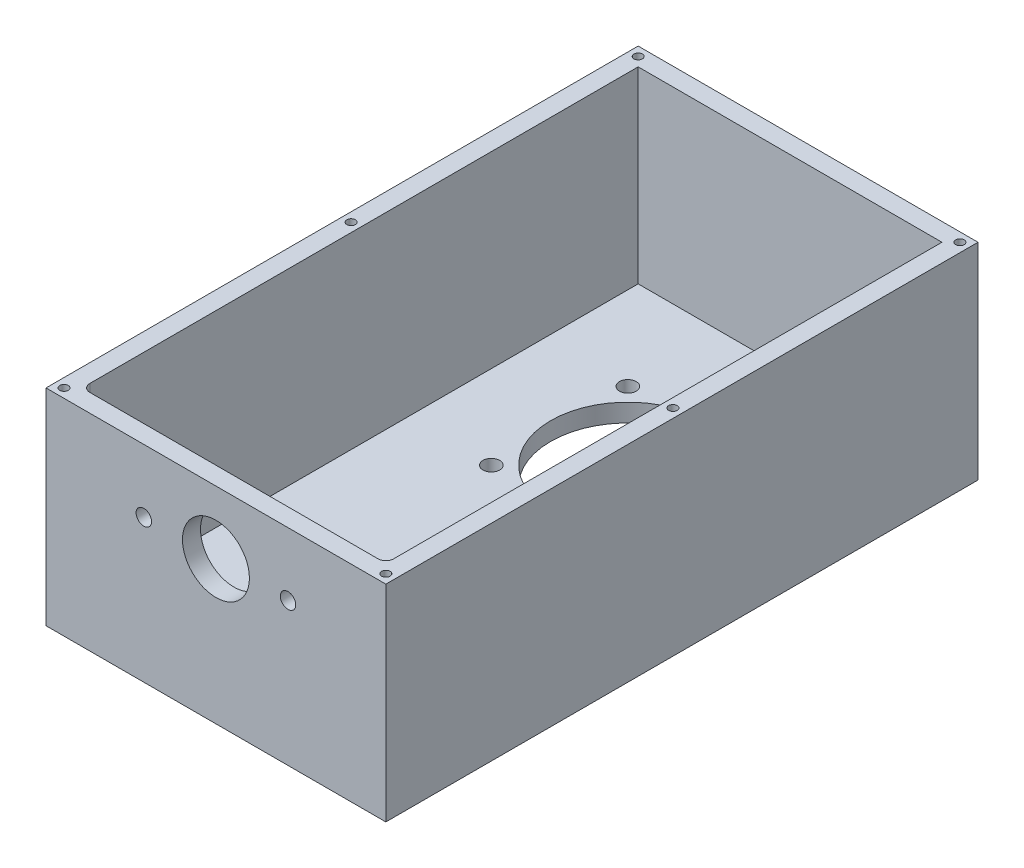
ISO-10303-21;
HEADER;
FILE_DESCRIPTION(('STEP AP214'),'2;1');
FILE_NAME('part.step','',(''),(''),'','','');
FILE_SCHEMA(('AUTOMOTIVE_DESIGN { 1 0 10303 214 1 1 1 1 }'));
ENDSEC;
DATA;
#1=APPLICATION_CONTEXT('core data for automotive mechanical design processes');
#2=APPLICATION_PROTOCOL_DEFINITION('international standard','automotive_design',2000,#1);
#3=PRODUCT_CONTEXT('',#1,'mechanical');
#4=PRODUCT('Part','Part','',(#3));
#5=PRODUCT_RELATED_PRODUCT_CATEGORY('part','',(#4));
#6=PRODUCT_DEFINITION_FORMATION('','',#4);
#7=PRODUCT_DEFINITION_CONTEXT('part definition',#1,'design');
#8=PRODUCT_DEFINITION('design','',#6,#7);
#9=PRODUCT_DEFINITION_SHAPE('','',#8);
#10=(LENGTH_UNIT() NAMED_UNIT(*) SI_UNIT(.MILLI.,.METRE.));
#11=(NAMED_UNIT(*) PLANE_ANGLE_UNIT() SI_UNIT($,.RADIAN.));
#12=(NAMED_UNIT(*) SI_UNIT($,.STERADIAN.) SOLID_ANGLE_UNIT());
#13=UNCERTAINTY_MEASURE_WITH_UNIT(LENGTH_MEASURE(1.E-05),#10,'distance_accuracy_value','');
#14=(GEOMETRIC_REPRESENTATION_CONTEXT(3) GLOBAL_UNCERTAINTY_ASSIGNED_CONTEXT((#13)) GLOBAL_UNIT_ASSIGNED_CONTEXT((#10,
#11,#12)) REPRESENTATION_CONTEXT('',''));
#15=CARTESIAN_POINT('',(0.,0.,0.));
#16=DIRECTION('',(0.,0.,1.));
#17=DIRECTION('',(1.,0.,0.));
#18=AXIS2_PLACEMENT_3D('',#15,#16,#17);
#19=CARTESIAN_POINT('',(66.,-40.,-230.));
#20=DIRECTION('',(1.,0.,0.));
#21=DIRECTION('',(0.,0.,-1.));
#22=AXIS2_PLACEMENT_3D('',#19,#20,#21);
#23=PLANE('',#22);
#24=DIRECTION('',(0.,1.,0.));
#25=VECTOR('',#24,1.);
#26=CARTESIAN_POINT('',(66.,-40.,0.));
#27=LINE('',#26,#25);
#28=CARTESIAN_POINT('',(66.,-40.,0.));
#29=VERTEX_POINT('',#28);
#30=CARTESIAN_POINT('',(66.,40.,0.));
#31=VERTEX_POINT('',#30);
#32=EDGE_CURVE('E242',#29,#31,#27,.T.);
#33=ORIENTED_EDGE('',*,*,#32,.F.);
#34=DIRECTION('',(0.,0.,1.));
#35=VECTOR('',#34,1.);
#36=CARTESIAN_POINT('',(66.,-40.,-230.));
#37=LINE('',#36,#35);
#38=CARTESIAN_POINT('',(66.,-40.,-230.));
#39=VERTEX_POINT('',#38);
#40=EDGE_CURVE('E269',#39,#29,#37,.T.);
#41=ORIENTED_EDGE('',*,*,#40,.F.);
#42=DIRECTION('',(0.,1.,0.));
#43=VECTOR('',#42,1.);
#44=CARTESIAN_POINT('',(66.,-40.,-230.));
#45=LINE('',#44,#43);
#46=CARTESIAN_POINT('',(66.,40.,-230.));
#47=VERTEX_POINT('',#46);
#48=EDGE_CURVE('E245',#39,#47,#45,.T.);
#49=ORIENTED_EDGE('',*,*,#48,.T.);
#50=DIRECTION('',(0.,0.,1.));
#51=VECTOR('',#50,1.);
#52=CARTESIAN_POINT('',(66.,40.,-230.));
#53=LINE('',#52,#51);
#54=EDGE_CURVE('E258',#47,#31,#53,.T.);
#55=ORIENTED_EDGE('',*,*,#54,.T.);
#56=EDGE_LOOP('',(#33,#41,#49,#55));
#57=FACE_BOUND('',#56,.T.);
#58=ADVANCED_FACE('F39',(#57),#23,.T.);
#59=CARTESIAN_POINT('',(-66.,-40.,-230.));
#60=DIRECTION('',(0.,-1.,0.));
#61=DIRECTION('',(0.,0.,-1.));
#62=AXIS2_PLACEMENT_3D('',#59,#60,#61);
#63=PLANE('',#62);
#64=CARTESIAN_POINT('',(-26.5165042944956,-40.,-186.516504294495));
#65=DIRECTION('',(0.,-1.,0.));
#66=DIRECTION('',(0.,0.,-1.));
#67=AXIS2_PLACEMENT_3D('',#64,#65,#66);
#68=CIRCLE('',#67,3.25000000000001);
#69=CARTESIAN_POINT('',(-26.5165042944956,-40.,-189.766504294495));
#70=VERTEX_POINT('',#69);
#71=EDGE_CURVE('E180',#70,#70,#68,.T.);
#72=ORIENTED_EDGE('',*,*,#71,.F.);
#73=EDGE_LOOP('',(#72));
#74=FACE_BOUND('',#73,.T.);
#75=CARTESIAN_POINT('',(-26.5165042944955,-40.,-133.483495705504));
#76=DIRECTION('',(0.,-1.,0.));
#77=DIRECTION('',(0.,0.,-1.));
#78=AXIS2_PLACEMENT_3D('',#75,#76,#77);
#79=CIRCLE('',#78,3.25000000000001);
#80=CARTESIAN_POINT('',(-26.5165042944955,-40.,-136.733495705504));
#81=VERTEX_POINT('',#80);
#82=EDGE_CURVE('E186',#81,#81,#79,.T.);
#83=ORIENTED_EDGE('',*,*,#82,.F.);
#84=EDGE_LOOP('',(#83));
#85=FACE_BOUND('',#84,.T.);
#86=CARTESIAN_POINT('',(26.5165042944956,-40.,-133.483495705504));
#87=DIRECTION('',(0.,-1.,0.));
#88=DIRECTION('',(0.,0.,-1.));
#89=AXIS2_PLACEMENT_3D('',#86,#87,#88);
#90=CIRCLE('',#89,3.25);
#91=CARTESIAN_POINT('',(26.5165042944956,-40.,-136.733495705504));
#92=VERTEX_POINT('',#91);
#93=EDGE_CURVE('E192',#92,#92,#90,.T.);
#94=ORIENTED_EDGE('',*,*,#93,.F.);
#95=EDGE_LOOP('',(#94));
#96=FACE_BOUND('',#95,.T.);
#97=CARTESIAN_POINT('',(0.,-40.,-160.));
#98=DIRECTION('',(0.,-1.,0.));
#99=DIRECTION('',(0.,0.,-1.));
#100=AXIS2_PLACEMENT_3D('',#97,#98,#99);
#101=CIRCLE('',#100,29.9999999999998);
#102=CARTESIAN_POINT('',(0.,-40.,-190.));
#103=VERTEX_POINT('',#102);
#104=EDGE_CURVE('E198',#103,#103,#101,.T.);
#105=ORIENTED_EDGE('',*,*,#104,.F.);
#106=EDGE_LOOP('',(#105));
#107=FACE_BOUND('',#106,.T.);
#108=CARTESIAN_POINT('',(26.5165042944955,-40.,-186.516504294496));
#109=DIRECTION('',(0.,-1.,0.));
#110=DIRECTION('',(0.,0.,-1.));
#111=AXIS2_PLACEMENT_3D('',#108,#109,#110);
#112=CIRCLE('',#111,3.25000000000002);
#113=CARTESIAN_POINT('',(26.5165042944955,-40.,-189.766504294496));
#114=VERTEX_POINT('',#113);
#115=EDGE_CURVE('E204',#114,#114,#112,.T.);
#116=ORIENTED_EDGE('',*,*,#115,.F.);
#117=EDGE_LOOP('',(#116));
#118=FACE_BOUND('',#117,.T.);
#119=DIRECTION('',(1.,0.,0.));
#120=VECTOR('',#119,1.);
#121=CARTESIAN_POINT('',(-66.,-40.,0.));
#122=LINE('',#121,#120);
#123=CARTESIAN_POINT('',(-66.,-40.,0.));
#124=VERTEX_POINT('',#123);
#125=EDGE_CURVE('E249',#124,#29,#122,.T.);
#126=ORIENTED_EDGE('',*,*,#125,.F.);
#127=DIRECTION('',(0.,0.,1.));
#128=VECTOR('',#127,1.);
#129=CARTESIAN_POINT('',(-66.,-40.,-230.));
#130=LINE('',#129,#128);
#131=CARTESIAN_POINT('',(-66.,-40.,-230.));
#132=VERTEX_POINT('',#131);
#133=EDGE_CURVE('E272',#132,#124,#130,.T.);
#134=ORIENTED_EDGE('',*,*,#133,.F.);
#135=DIRECTION('',(1.,0.,0.));
#136=VECTOR('',#135,1.);
#137=CARTESIAN_POINT('',(-66.,-40.,-230.));
#138=LINE('',#137,#136);
#139=EDGE_CURVE('E255',#132,#39,#138,.T.);
#140=ORIENTED_EDGE('',*,*,#139,.T.);
#141=ORIENTED_EDGE('',*,*,#40,.T.);
#142=EDGE_LOOP('',(#126,#134,#140,#141));
#143=FACE_BOUND('',#142,.T.);
#144=ADVANCED_FACE('F329',(#74,#85,#96,#107,#118,#143),#63,.T.);
#145=CARTESIAN_POINT('',(-66.,-40.,-230.));
#146=DIRECTION('',(-1.,0.,0.));
#147=DIRECTION('',(0.,0.,1.));
#148=AXIS2_PLACEMENT_3D('',#145,#146,#147);
#149=PLANE('',#148);
#150=DIRECTION('',(0.,-1.,0.));
#151=VECTOR('',#150,1.);
#152=CARTESIAN_POINT('',(-66.,-40.,0.));
#153=LINE('',#152,#151);
#154=CARTESIAN_POINT('',(-66.,40.,0.));
#155=VERTEX_POINT('',#154);
#156=EDGE_CURVE('E264',#155,#124,#153,.T.);
#157=ORIENTED_EDGE('',*,*,#156,.F.);
#158=DIRECTION('',(0.,0.,1.));
#159=VECTOR('',#158,1.);
#160=CARTESIAN_POINT('',(-66.,40.,-230.));
#161=LINE('',#160,#159);
#162=CARTESIAN_POINT('',(-66.,40.,-230.));
#163=VERTEX_POINT('',#162);
#164=EDGE_CURVE('E274',#163,#155,#161,.T.);
#165=ORIENTED_EDGE('',*,*,#164,.F.);
#166=DIRECTION('',(0.,-1.,0.));
#167=VECTOR('',#166,1.);
#168=CARTESIAN_POINT('',(-66.,-40.,-230.));
#169=LINE('',#168,#167);
#170=EDGE_CURVE('E252',#163,#132,#169,.T.);
#171=ORIENTED_EDGE('',*,*,#170,.T.);
#172=ORIENTED_EDGE('',*,*,#133,.T.);
#173=EDGE_LOOP('',(#157,#165,#171,#172));
#174=FACE_BOUND('',#173,.T.);
#175=ADVANCED_FACE('F335',(#174),#149,.T.);
#176=CARTESIAN_POINT('',(-66.,40.,-230.));
#177=DIRECTION('',(0.,1.,0.));
#178=DIRECTION('',(0.,0.,1.));
#179=AXIS2_PLACEMENT_3D('',#176,#177,#178);
#180=PLANE('',#179);
#181=CARTESIAN_POINT('',(-62.5,40.,-226.5));
#182=DIRECTION('',(0.,1.,0.));
#183=DIRECTION('',(0.,0.,1.));
#184=AXIS2_PLACEMENT_3D('',#181,#182,#183);
#185=CIRCLE('',#184,1.64999999999999);
#186=CARTESIAN_POINT('',(-62.5,40.,-224.85));
#187=VERTEX_POINT('',#186);
#188=EDGE_CURVE('E143',#187,#187,#185,.T.);
#189=ORIENTED_EDGE('',*,*,#188,.F.);
#190=EDGE_LOOP('',(#189));
#191=FACE_BOUND('',#190,.T.);
#192=CARTESIAN_POINT('',(-62.5,40.,-115.));
#193=DIRECTION('',(0.,1.,0.));
#194=DIRECTION('',(0.,0.,1.));
#195=AXIS2_PLACEMENT_3D('',#192,#193,#194);
#196=CIRCLE('',#195,1.64999999999999);
#197=CARTESIAN_POINT('',(-62.5,40.,-113.35));
#198=VERTEX_POINT('',#197);
#199=EDGE_CURVE('E142',#198,#198,#196,.T.);
#200=ORIENTED_EDGE('',*,*,#199,.F.);
#201=EDGE_LOOP('',(#200));
#202=FACE_BOUND('',#201,.T.);
#203=CARTESIAN_POINT('',(62.5,40.,-115.));
#204=DIRECTION('',(0.,1.,0.));
#205=DIRECTION('',(0.,0.,1.));
#206=AXIS2_PLACEMENT_3D('',#203,#204,#205);
#207=CIRCLE('',#206,1.64999999999998);
#208=CARTESIAN_POINT('',(62.5,40.,-113.35));
#209=VERTEX_POINT('',#208);
#210=EDGE_CURVE('E153',#209,#209,#207,.T.);
#211=ORIENTED_EDGE('',*,*,#210,.F.);
#212=EDGE_LOOP('',(#211));
#213=FACE_BOUND('',#212,.T.);
#214=CARTESIAN_POINT('',(62.5,40.,-226.5));
#215=DIRECTION('',(0.,1.,0.));
#216=DIRECTION('',(0.,0.,1.));
#217=AXIS2_PLACEMENT_3D('',#214,#215,#216);
#218=CIRCLE('',#217,1.64999999999998);
#219=CARTESIAN_POINT('',(62.5,40.,-224.85));
#220=VERTEX_POINT('',#219);
#221=EDGE_CURVE('E159',#220,#220,#218,.T.);
#222=ORIENTED_EDGE('',*,*,#221,.F.);
#223=EDGE_LOOP('',(#222));
#224=FACE_BOUND('',#223,.T.);
#225=CARTESIAN_POINT('',(62.5,40.,-3.5));
#226=DIRECTION('',(0.,1.,0.));
#227=DIRECTION('',(0.,0.,1.));
#228=AXIS2_PLACEMENT_3D('',#225,#226,#227);
#229=CIRCLE('',#228,1.64999999999998);
#230=CARTESIAN_POINT('',(62.5,40.,-1.85000000000001));
#231=VERTEX_POINT('',#230);
#232=EDGE_CURVE('E165',#231,#231,#229,.T.);
#233=ORIENTED_EDGE('',*,*,#232,.F.);
#234=EDGE_LOOP('',(#233));
#235=FACE_BOUND('',#234,.T.);
#236=CARTESIAN_POINT('',(-62.5,40.,-3.5));
#237=DIRECTION('',(0.,1.,0.));
#238=DIRECTION('',(0.,0.,1.));
#239=AXIS2_PLACEMENT_3D('',#236,#237,#238);
#240=CIRCLE('',#239,1.64999999999999);
#241=CARTESIAN_POINT('',(-62.5,40.,-1.85000000000001));
#242=VERTEX_POINT('',#241);
#243=EDGE_CURVE('E171',#242,#242,#240,.T.);
#244=ORIENTED_EDGE('',*,*,#243,.F.);
#245=EDGE_LOOP('',(#244));
#246=FACE_BOUND('',#245,.T.);
#247=DIRECTION('',(0.,0.,1.));
#248=VECTOR('',#247,1.);
#249=CARTESIAN_POINT('',(-59.,40.,-7.));
#250=LINE('',#249,#248);
#251=CARTESIAN_POINT('',(-59.0000000000001,40.,-223.));
#252=VERTEX_POINT('',#251);
#253=CARTESIAN_POINT('',(-59.,40.,-10.));
#254=VERTEX_POINT('',#253);
#255=EDGE_CURVE('E231',#252,#254,#250,.T.);
#256=ORIENTED_EDGE('',*,*,#255,.F.);
#257=DIRECTION('',(-1.,0.,0.));
#258=VECTOR('',#257,1.);
#259=CARTESIAN_POINT('',(-59.0000000000001,40.,-223.));
#260=LINE('',#259,#258);
#261=CARTESIAN_POINT('',(59.0000000000001,40.,-223.));
#262=VERTEX_POINT('',#261);
#263=EDGE_CURVE('E222',#262,#252,#260,.T.);
#264=ORIENTED_EDGE('',*,*,#263,.F.);
#265=DIRECTION('',(0.,0.,-1.));
#266=VECTOR('',#265,1.);
#267=CARTESIAN_POINT('',(59.,40.,-7.));
#268=LINE('',#267,#266);
#269=CARTESIAN_POINT('',(59.,40.,-10.));
#270=VERTEX_POINT('',#269);
#271=EDGE_CURVE('E236',#270,#262,#268,.T.);
#272=ORIENTED_EDGE('',*,*,#271,.F.);
#273=CARTESIAN_POINT('',(56.,40.,-10.));
#274=DIRECTION('',(0.,1.,0.));
#275=DIRECTION('',(0.,0.,1.));
#276=AXIS2_PLACEMENT_3D('',#273,#274,#275);
#277=CIRCLE('',#276,3.);
#278=CARTESIAN_POINT('',(56.,40.,-7.));
#279=VERTEX_POINT('',#278);
#280=EDGE_CURVE('E47',#270,#279,#277,.F.);
#281=ORIENTED_EDGE('',*,*,#280,.T.);
#282=DIRECTION('',(1.,0.,0.));
#283=VECTOR('',#282,1.);
#284=CARTESIAN_POINT('',(-59.,40.,-7.));
#285=LINE('',#284,#283);
#286=CARTESIAN_POINT('',(-56.,40.,-7.));
#287=VERTEX_POINT('',#286);
#288=EDGE_CURVE('E233',#287,#279,#285,.T.);
#289=ORIENTED_EDGE('',*,*,#288,.F.);
#290=CARTESIAN_POINT('',(-56.,40.,-10.));
#291=DIRECTION('',(0.,1.,0.));
#292=DIRECTION('',(0.,0.,1.));
#293=AXIS2_PLACEMENT_3D('',#290,#291,#292);
#294=CIRCLE('',#293,3.);
#295=EDGE_CURVE('E12',#287,#254,#294,.F.);
#296=ORIENTED_EDGE('',*,*,#295,.T.);
#297=EDGE_LOOP('',(#256,#264,#272,#281,#289,#296));
#298=FACE_BOUND('',#297,.T.);
#299=DIRECTION('',(-1.,0.,0.));
#300=VECTOR('',#299,1.);
#301=CARTESIAN_POINT('',(-66.,40.,0.));
#302=LINE('',#301,#300);
#303=EDGE_CURVE('E261',#31,#155,#302,.T.);
#304=ORIENTED_EDGE('',*,*,#303,.F.);
#305=ORIENTED_EDGE('',*,*,#54,.F.);
#306=DIRECTION('',(-1.,0.,0.));
#307=VECTOR('',#306,1.);
#308=CARTESIAN_POINT('',(-66.,40.,-230.));
#309=LINE('',#308,#307);
#310=EDGE_CURVE('E248',#47,#163,#309,.T.);
#311=ORIENTED_EDGE('',*,*,#310,.T.);
#312=ORIENTED_EDGE('',*,*,#164,.T.);
#313=EDGE_LOOP('',(#304,#305,#311,#312));
#314=FACE_BOUND('',#313,.T.);
#315=ADVANCED_FACE('F295',(#191,#202,#213,#224,#235,#246,#298,#314),#180,.T.);
#316=CARTESIAN_POINT('',(0.,0.,-230.));
#317=DIRECTION('',(0.,0.,-1.));
#318=DIRECTION('',(-1.,0.,0.));
#319=AXIS2_PLACEMENT_3D('',#316,#317,#318);
#320=PLANE('',#319);
#321=ORIENTED_EDGE('',*,*,#48,.F.);
#322=ORIENTED_EDGE('',*,*,#139,.F.);
#323=ORIENTED_EDGE('',*,*,#170,.F.);
#324=ORIENTED_EDGE('',*,*,#310,.F.);
#325=EDGE_LOOP('',(#321,#322,#323,#324));
#326=FACE_BOUND('',#325,.T.);
#327=ADVANCED_FACE('F342',(#326),#320,.T.);
#328=CARTESIAN_POINT('',(0.,0.,0.));
#329=DIRECTION('',(0.,0.,-1.));
#330=DIRECTION('',(-1.,0.,0.));
#331=AXIS2_PLACEMENT_3D('',#328,#329,#330);
#332=PLANE('',#331);
#333=CARTESIAN_POINT('',(28.,15.5,0.));
#334=DIRECTION('',(0.,0.,1.));
#335=DIRECTION('',(-1.,0.,0.));
#336=AXIS2_PLACEMENT_3D('',#333,#334,#335);
#337=CIRCLE('',#336,3.);
#338=CARTESIAN_POINT('',(25.,15.5,0.));
#339=VERTEX_POINT('',#338);
#340=EDGE_CURVE('E207',#339,#339,#337,.T.);
#341=ORIENTED_EDGE('',*,*,#340,.F.);
#342=EDGE_LOOP('',(#341));
#343=FACE_BOUND('',#342,.T.);
#344=CARTESIAN_POINT('',(-28.,15.5,0.));
#345=DIRECTION('',(0.,0.,1.));
#346=DIRECTION('',(1.,0.,0.));
#347=AXIS2_PLACEMENT_3D('',#344,#345,#346);
#348=CIRCLE('',#347,3.);
#349=CARTESIAN_POINT('',(-25.,15.5,0.));
#350=VERTEX_POINT('',#349);
#351=EDGE_CURVE('E211',#350,#350,#348,.T.);
#352=ORIENTED_EDGE('',*,*,#351,.F.);
#353=EDGE_LOOP('',(#352));
#354=FACE_BOUND('',#353,.T.);
#355=CARTESIAN_POINT('',(0.,15.5,0.));
#356=DIRECTION('',(0.,0.,1.));
#357=DIRECTION('',(1.,0.,0.));
#358=AXIS2_PLACEMENT_3D('',#355,#356,#357);
#359=CIRCLE('',#358,13.);
#360=CARTESIAN_POINT('',(13.,15.5,0.));
#361=VERTEX_POINT('',#360);
#362=EDGE_CURVE('E215',#361,#361,#359,.T.);
#363=ORIENTED_EDGE('',*,*,#362,.F.);
#364=EDGE_LOOP('',(#363));
#365=FACE_BOUND('',#364,.T.);
#366=ORIENTED_EDGE('',*,*,#32,.T.);
#367=ORIENTED_EDGE('',*,*,#303,.T.);
#368=ORIENTED_EDGE('',*,*,#156,.T.);
#369=ORIENTED_EDGE('',*,*,#125,.T.);
#370=EDGE_LOOP('',(#366,#367,#368,#369));
#371=FACE_BOUND('',#370,.T.);
#372=ADVANCED_FACE('F347',(#343,#354,#365,#371),#332,.F.);
#373=CARTESIAN_POINT('',(-59.,-33.,-7.));
#374=DIRECTION('',(-1.,0.,0.));
#375=DIRECTION('',(0.,0.,1.));
#376=AXIS2_PLACEMENT_3D('',#373,#374,#375);
#377=PLANE('',#376);
#378=ORIENTED_EDGE('',*,*,#255,.T.);
#379=DIRECTION('',(0.,1.,0.));
#380=VECTOR('',#379,1.);
#381=CARTESIAN_POINT('',(-59.,-33.,-10.));
#382=LINE('',#381,#380);
#383=CARTESIAN_POINT('',(-59.,-33.,-10.));
#384=VERTEX_POINT('',#383);
#385=EDGE_CURVE('E59',#254,#384,#382,.F.);
#386=ORIENTED_EDGE('',*,*,#385,.T.);
#387=DIRECTION('',(0.,0.,1.));
#388=VECTOR('',#387,1.);
#389=CARTESIAN_POINT('',(-59.,-33.,-7.));
#390=LINE('',#389,#388);
#391=CARTESIAN_POINT('',(-59.0000000000001,-33.,-223.));
#392=VERTEX_POINT('',#391);
#393=EDGE_CURVE('E219',#392,#384,#390,.T.);
#394=ORIENTED_EDGE('',*,*,#393,.F.);
#395=DIRECTION('',(0.,1.,0.));
#396=VECTOR('',#395,1.);
#397=CARTESIAN_POINT('',(-59.0000000000001,-33.,-223.));
#398=LINE('',#397,#396);
#399=EDGE_CURVE('E240',#392,#252,#398,.T.);
#400=ORIENTED_EDGE('',*,*,#399,.T.);
#401=EDGE_LOOP('',(#378,#386,#394,#400));
#402=FACE_BOUND('',#401,.T.);
#403=ADVANCED_FACE('F350',(#402),#377,.F.);
#404=CARTESIAN_POINT('',(-59.0000000000001,-33.,-223.));
#405=DIRECTION('',(0.,0.,-1.));
#406=DIRECTION('',(-1.,0.,0.));
#407=AXIS2_PLACEMENT_3D('',#404,#405,#406);
#408=PLANE('',#407);
#409=ORIENTED_EDGE('',*,*,#263,.T.);
#410=ORIENTED_EDGE('',*,*,#399,.F.);
#411=DIRECTION('',(-1.,0.,0.));
#412=VECTOR('',#411,1.);
#413=CARTESIAN_POINT('',(-59.0000000000001,-33.,-223.));
#414=LINE('',#413,#412);
#415=CARTESIAN_POINT('',(59.0000000000001,-33.,-223.));
#416=VERTEX_POINT('',#415);
#417=EDGE_CURVE('E227',#416,#392,#414,.T.);
#418=ORIENTED_EDGE('',*,*,#417,.F.);
#419=DIRECTION('',(0.,1.,0.));
#420=VECTOR('',#419,1.);
#421=CARTESIAN_POINT('',(59.0000000000001,-33.,-223.));
#422=LINE('',#421,#420);
#423=EDGE_CURVE('E230',#416,#262,#422,.T.);
#424=ORIENTED_EDGE('',*,*,#423,.T.);
#425=EDGE_LOOP('',(#409,#410,#418,#424));
#426=FACE_BOUND('',#425,.T.);
#427=ADVANCED_FACE('F315',(#426),#408,.F.);
#428=CARTESIAN_POINT('',(59.,-33.,-7.));
#429=DIRECTION('',(1.,0.,0.));
#430=DIRECTION('',(0.,0.,-1.));
#431=AXIS2_PLACEMENT_3D('',#428,#429,#430);
#432=PLANE('',#431);
#433=DIRECTION('',(0.,0.,-1.));
#434=VECTOR('',#433,1.);
#435=CARTESIAN_POINT('',(59.,-33.,-7.));
#436=LINE('',#435,#434);
#437=CARTESIAN_POINT('',(59.,-33.,-10.));
#438=VERTEX_POINT('',#437);
#439=EDGE_CURVE('E225',#438,#416,#436,.T.);
#440=ORIENTED_EDGE('',*,*,#439,.F.);
#441=DIRECTION('',(0.,1.,0.));
#442=VECTOR('',#441,1.);
#443=CARTESIAN_POINT('',(59.,40.,-10.));
#444=LINE('',#443,#442);
#445=EDGE_CURVE('E271',#438,#270,#444,.T.);
#446=ORIENTED_EDGE('',*,*,#445,.T.);
#447=ORIENTED_EDGE('',*,*,#271,.T.);
#448=ORIENTED_EDGE('',*,*,#423,.F.);
#449=EDGE_LOOP('',(#440,#446,#447,#448));
#450=FACE_BOUND('',#449,.T.);
#451=ADVANCED_FACE('F312',(#450),#432,.F.);
#452=CARTESIAN_POINT('',(-59.,-33.,-7.));
#453=DIRECTION('',(0.,0.,1.));
#454=DIRECTION('',(1.,0.,0.));
#455=AXIS2_PLACEMENT_3D('',#452,#453,#454);
#456=PLANE('',#455);
#457=CARTESIAN_POINT('',(28.,15.5,-7.));
#458=DIRECTION('',(0.,0.,1.));
#459=DIRECTION('',(1.,0.,0.));
#460=AXIS2_PLACEMENT_3D('',#457,#458,#459);
#461=CIRCLE('',#460,3.);
#462=CARTESIAN_POINT('',(31.,15.5,-7.));
#463=VERTEX_POINT('',#462);
#464=EDGE_CURVE('E210',#463,#463,#461,.T.);
#465=ORIENTED_EDGE('',*,*,#464,.T.);
#466=EDGE_LOOP('',(#465));
#467=FACE_BOUND('',#466,.T.);
#468=CARTESIAN_POINT('',(-28.,15.5,-7.));
#469=DIRECTION('',(0.,0.,1.));
#470=DIRECTION('',(1.,0.,0.));
#471=AXIS2_PLACEMENT_3D('',#468,#469,#470);
#472=CIRCLE('',#471,3.);
#473=CARTESIAN_POINT('',(-25.,15.5,-7.));
#474=VERTEX_POINT('',#473);
#475=EDGE_CURVE('E214',#474,#474,#472,.T.);
#476=ORIENTED_EDGE('',*,*,#475,.T.);
#477=EDGE_LOOP('',(#476));
#478=FACE_BOUND('',#477,.T.);
#479=CARTESIAN_POINT('',(0.,15.5,-7.));
#480=DIRECTION('',(0.,0.,1.));
#481=DIRECTION('',(1.,0.,0.));
#482=AXIS2_PLACEMENT_3D('',#479,#480,#481);
#483=CIRCLE('',#482,13.);
#484=CARTESIAN_POINT('',(13.,15.5,-7.));
#485=VERTEX_POINT('',#484);
#486=EDGE_CURVE('E218',#485,#485,#483,.T.);
#487=ORIENTED_EDGE('',*,*,#486,.T.);
#488=EDGE_LOOP('',(#487));
#489=FACE_BOUND('',#488,.T.);
#490=ORIENTED_EDGE('',*,*,#288,.T.);
#491=DIRECTION('',(0.,1.,0.));
#492=VECTOR('',#491,1.);
#493=CARTESIAN_POINT('',(56.,-33.,-7.));
#494=LINE('',#493,#492);
#495=CARTESIAN_POINT('',(56.,-33.,-7.));
#496=VERTEX_POINT('',#495);
#497=EDGE_CURVE('E288',#279,#496,#494,.F.);
#498=ORIENTED_EDGE('',*,*,#497,.T.);
#499=DIRECTION('',(1.,0.,0.));
#500=VECTOR('',#499,1.);
#501=CARTESIAN_POINT('',(-59.,-33.,-7.));
#502=LINE('',#501,#500);
#503=CARTESIAN_POINT('',(-56.,-33.,-7.));
#504=VERTEX_POINT('',#503);
#505=EDGE_CURVE('E221',#504,#496,#502,.T.);
#506=ORIENTED_EDGE('',*,*,#505,.F.);
#507=DIRECTION('',(0.,1.,0.));
#508=VECTOR('',#507,1.);
#509=CARTESIAN_POINT('',(-56.,40.,-7.));
#510=LINE('',#509,#508);
#511=EDGE_CURVE('E285',#504,#287,#510,.T.);
#512=ORIENTED_EDGE('',*,*,#511,.T.);
#513=EDGE_LOOP('',(#490,#498,#506,#512));
#514=FACE_BOUND('',#513,.T.);
#515=ADVANCED_FACE('F302',(#467,#478,#489,#514),#456,.F.);
#516=CARTESIAN_POINT('',(0.,-33.,0.));
#517=DIRECTION('',(0.,-1.,0.));
#518=DIRECTION('',(0.,0.,-1.));
#519=AXIS2_PLACEMENT_3D('',#516,#517,#518);
#520=PLANE('',#519);
#521=CARTESIAN_POINT('',(-26.5165042944956,-33.,-186.516504294495));
#522=DIRECTION('',(0.,1.,0.));
#523=DIRECTION('',(0.,0.,1.));
#524=AXIS2_PLACEMENT_3D('',#521,#522,#523);
#525=CIRCLE('',#524,3.25000000000001);
#526=CARTESIAN_POINT('',(-26.5165042944956,-33.,-183.266504294495));
#527=VERTEX_POINT('',#526);
#528=EDGE_CURVE('E177',#527,#527,#525,.T.);
#529=ORIENTED_EDGE('',*,*,#528,.F.);
#530=EDGE_LOOP('',(#529));
#531=FACE_BOUND('',#530,.T.);
#532=CARTESIAN_POINT('',(-26.5165042944955,-33.,-133.483495705504));
#533=DIRECTION('',(0.,1.,0.));
#534=DIRECTION('',(0.,0.,1.));
#535=AXIS2_PLACEMENT_3D('',#532,#533,#534);
#536=CIRCLE('',#535,3.25000000000001);
#537=CARTESIAN_POINT('',(-26.5165042944955,-33.,-130.233495705504));
#538=VERTEX_POINT('',#537);
#539=EDGE_CURVE('E183',#538,#538,#536,.T.);
#540=ORIENTED_EDGE('',*,*,#539,.F.);
#541=EDGE_LOOP('',(#540));
#542=FACE_BOUND('',#541,.T.);
#543=CARTESIAN_POINT('',(26.5165042944956,-33.,-133.483495705504));
#544=DIRECTION('',(0.,1.,0.));
#545=DIRECTION('',(0.,0.,1.));
#546=AXIS2_PLACEMENT_3D('',#543,#544,#545);
#547=CIRCLE('',#546,3.25);
#548=CARTESIAN_POINT('',(26.5165042944956,-33.,-130.233495705504));
#549=VERTEX_POINT('',#548);
#550=EDGE_CURVE('E189',#549,#549,#547,.T.);
#551=ORIENTED_EDGE('',*,*,#550,.F.);
#552=EDGE_LOOP('',(#551));
#553=FACE_BOUND('',#552,.T.);
#554=CARTESIAN_POINT('',(0.,-33.,-160.));
#555=DIRECTION('',(0.,1.,0.));
#556=DIRECTION('',(0.,0.,1.));
#557=AXIS2_PLACEMENT_3D('',#554,#555,#556);
#558=CIRCLE('',#557,29.9999999999998);
#559=CARTESIAN_POINT('',(0.,-33.,-130.));
#560=VERTEX_POINT('',#559);
#561=EDGE_CURVE('E195',#560,#560,#558,.T.);
#562=ORIENTED_EDGE('',*,*,#561,.F.);
#563=EDGE_LOOP('',(#562));
#564=FACE_BOUND('',#563,.T.);
#565=CARTESIAN_POINT('',(26.5165042944955,-33.,-186.516504294496));
#566=DIRECTION('',(0.,1.,0.));
#567=DIRECTION('',(0.,0.,1.));
#568=AXIS2_PLACEMENT_3D('',#565,#566,#567);
#569=CIRCLE('',#568,3.25000000000002);
#570=CARTESIAN_POINT('',(26.5165042944955,-33.,-183.266504294496));
#571=VERTEX_POINT('',#570);
#572=EDGE_CURVE('E201',#571,#571,#569,.T.);
#573=ORIENTED_EDGE('',*,*,#572,.F.);
#574=EDGE_LOOP('',(#573));
#575=FACE_BOUND('',#574,.T.);
#576=ORIENTED_EDGE('',*,*,#505,.T.);
#577=CARTESIAN_POINT('',(56.,-33.,-10.));
#578=DIRECTION('',(0.,-1.,0.));
#579=DIRECTION('',(0.,0.,-1.));
#580=AXIS2_PLACEMENT_3D('',#577,#578,#579);
#581=CIRCLE('',#580,3.);
#582=EDGE_CURVE('E292',#496,#438,#581,.F.);
#583=ORIENTED_EDGE('',*,*,#582,.T.);
#584=ORIENTED_EDGE('',*,*,#439,.T.);
#585=ORIENTED_EDGE('',*,*,#417,.T.);
#586=ORIENTED_EDGE('',*,*,#393,.T.);
#587=CARTESIAN_POINT('',(-56.,-33.,-10.));
#588=DIRECTION('',(0.,-1.,0.));
#589=DIRECTION('',(0.,0.,-1.));
#590=AXIS2_PLACEMENT_3D('',#587,#588,#589);
#591=CIRCLE('',#590,3.);
#592=EDGE_CURVE('E290',#384,#504,#591,.F.);
#593=ORIENTED_EDGE('',*,*,#592,.T.);
#594=EDGE_LOOP('',(#576,#583,#584,#585,#586,#593));
#595=FACE_BOUND('',#594,.T.);
#596=ADVANCED_FACE('F309',(#531,#542,#553,#564,#575,#595),#520,.F.);
#597=CARTESIAN_POINT('',(0.,15.5,-10.));
#598=DIRECTION('',(0.,0.,1.));
#599=DIRECTION('',(1.,0.,0.));
#600=AXIS2_PLACEMENT_3D('',#597,#598,#599);
#601=CYLINDRICAL_SURFACE('',#600,13.);
#602=ORIENTED_EDGE('',*,*,#362,.T.);
#603=EDGE_LOOP('',(#602));
#604=FACE_BOUND('',#603,.T.);
#605=ORIENTED_EDGE('',*,*,#486,.F.);
#606=EDGE_LOOP('',(#605));
#607=FACE_BOUND('',#606,.T.);
#608=ADVANCED_FACE('F366',(#604,#607),#601,.F.);
#609=CARTESIAN_POINT('',(-28.,15.5,-10.));
#610=DIRECTION('',(0.,0.,1.));
#611=DIRECTION('',(1.,0.,0.));
#612=AXIS2_PLACEMENT_3D('',#609,#610,#611);
#613=CYLINDRICAL_SURFACE('',#612,3.);
#614=ORIENTED_EDGE('',*,*,#351,.T.);
#615=EDGE_LOOP('',(#614));
#616=FACE_BOUND('',#615,.T.);
#617=ORIENTED_EDGE('',*,*,#475,.F.);
#618=EDGE_LOOP('',(#617));
#619=FACE_BOUND('',#618,.T.);
#620=ADVANCED_FACE('F370',(#616,#619),#613,.F.);
#621=CARTESIAN_POINT('',(28.,15.5,-10.));
#622=DIRECTION('',(0.,0.,1.));
#623=DIRECTION('',(1.,0.,0.));
#624=AXIS2_PLACEMENT_3D('',#621,#622,#623);
#625=CYLINDRICAL_SURFACE('',#624,3.);
#626=ORIENTED_EDGE('',*,*,#340,.T.);
#627=EDGE_LOOP('',(#626));
#628=FACE_BOUND('',#627,.T.);
#629=ORIENTED_EDGE('',*,*,#464,.F.);
#630=EDGE_LOOP('',(#629));
#631=FACE_BOUND('',#630,.T.);
#632=ADVANCED_FACE('F374',(#628,#631),#625,.F.);
#633=CARTESIAN_POINT('',(26.5165042944955,-43.,-186.516504294496));
#634=DIRECTION('',(0.,1.,0.));
#635=DIRECTION('',(0.,0.,1.));
#636=AXIS2_PLACEMENT_3D('',#633,#634,#635);
#637=CYLINDRICAL_SURFACE('',#636,3.25000000000002);
#638=ORIENTED_EDGE('',*,*,#115,.T.);
#639=EDGE_LOOP('',(#638));
#640=FACE_BOUND('',#639,.T.);
#641=ORIENTED_EDGE('',*,*,#572,.T.);
#642=EDGE_LOOP('',(#641));
#643=FACE_BOUND('',#642,.T.);
#644=ADVANCED_FACE('F378',(#640,#643),#637,.F.);
#645=CARTESIAN_POINT('',(0.,-43.,-160.));
#646=DIRECTION('',(0.,1.,0.));
#647=DIRECTION('',(0.,0.,1.));
#648=AXIS2_PLACEMENT_3D('',#645,#646,#647);
#649=CYLINDRICAL_SURFACE('',#648,29.9999999999998);
#650=ORIENTED_EDGE('',*,*,#104,.T.);
#651=EDGE_LOOP('',(#650));
#652=FACE_BOUND('',#651,.T.);
#653=ORIENTED_EDGE('',*,*,#561,.T.);
#654=EDGE_LOOP('',(#653));
#655=FACE_BOUND('',#654,.T.);
#656=ADVANCED_FACE('F382',(#652,#655),#649,.F.);
#657=CARTESIAN_POINT('',(26.5165042944956,-43.,-133.483495705504));
#658=DIRECTION('',(0.,1.,0.));
#659=DIRECTION('',(0.,0.,1.));
#660=AXIS2_PLACEMENT_3D('',#657,#658,#659);
#661=CYLINDRICAL_SURFACE('',#660,3.25);
#662=ORIENTED_EDGE('',*,*,#93,.T.);
#663=EDGE_LOOP('',(#662));
#664=FACE_BOUND('',#663,.T.);
#665=ORIENTED_EDGE('',*,*,#550,.T.);
#666=EDGE_LOOP('',(#665));
#667=FACE_BOUND('',#666,.T.);
#668=ADVANCED_FACE('F386',(#664,#667),#661,.F.);
#669=CARTESIAN_POINT('',(-26.5165042944955,-43.,-133.483495705504));
#670=DIRECTION('',(0.,1.,0.));
#671=DIRECTION('',(0.,0.,1.));
#672=AXIS2_PLACEMENT_3D('',#669,#670,#671);
#673=CYLINDRICAL_SURFACE('',#672,3.25000000000001);
#674=ORIENTED_EDGE('',*,*,#82,.T.);
#675=EDGE_LOOP('',(#674));
#676=FACE_BOUND('',#675,.T.);
#677=ORIENTED_EDGE('',*,*,#539,.T.);
#678=EDGE_LOOP('',(#677));
#679=FACE_BOUND('',#678,.T.);
#680=ADVANCED_FACE('F390',(#676,#679),#673,.F.);
#681=CARTESIAN_POINT('',(-26.5165042944956,-43.,-186.516504294495));
#682=DIRECTION('',(0.,1.,0.));
#683=DIRECTION('',(0.,0.,1.));
#684=AXIS2_PLACEMENT_3D('',#681,#682,#683);
#685=CYLINDRICAL_SURFACE('',#684,3.25000000000001);
#686=ORIENTED_EDGE('',*,*,#71,.T.);
#687=EDGE_LOOP('',(#686));
#688=FACE_BOUND('',#687,.T.);
#689=ORIENTED_EDGE('',*,*,#528,.T.);
#690=EDGE_LOOP('',(#689));
#691=FACE_BOUND('',#690,.T.);
#692=ADVANCED_FACE('F327',(#688,#691),#685,.F.);
#693=CARTESIAN_POINT('',(56.,-33.,-10.));
#694=DIRECTION('',(0.,-1.,0.));
#695=DIRECTION('',(0.,0.,-1.));
#696=AXIS2_PLACEMENT_3D('',#693,#694,#695);
#697=CYLINDRICAL_SURFACE('',#696,3.);
#698=ORIENTED_EDGE('',*,*,#582,.F.);
#699=ORIENTED_EDGE('',*,*,#497,.F.);
#700=ORIENTED_EDGE('',*,*,#280,.F.);
#701=ORIENTED_EDGE('',*,*,#445,.F.);
#702=EDGE_LOOP('',(#698,#699,#700,#701));
#703=FACE_BOUND('',#702,.T.);
#704=ADVANCED_FACE('F306',(#703),#697,.F.);
#705=CARTESIAN_POINT('',(-56.,-33.,-10.));
#706=DIRECTION('',(0.,-1.,0.));
#707=DIRECTION('',(0.,0.,-1.));
#708=AXIS2_PLACEMENT_3D('',#705,#706,#707);
#709=CYLINDRICAL_SURFACE('',#708,3.);
#710=ORIENTED_EDGE('',*,*,#592,.F.);
#711=ORIENTED_EDGE('',*,*,#385,.F.);
#712=ORIENTED_EDGE('',*,*,#295,.F.);
#713=ORIENTED_EDGE('',*,*,#511,.F.);
#714=EDGE_LOOP('',(#710,#711,#712,#713));
#715=FACE_BOUND('',#714,.T.);
#716=ADVANCED_FACE('F41',(#715),#709,.F.);
#717=CARTESIAN_POINT('',(-62.5,29.9,-3.5));
#718=DIRECTION('',(0.,1.,0.));
#719=DIRECTION('',(0.,0.,1.));
#720=AXIS2_PLACEMENT_3D('',#717,#718,#719);
#721=CONICAL_SURFACE('',#720,1.64999999999998,1.02974425867665);
#722=CARTESIAN_POINT('',(-62.5,28.9085799786045,-3.5));
#723=VERTEX_POINT('',#722);
#724=VERTEX_LOOP('',#723);
#725=FACE_BOUND('',#724,.T.);
#726=CARTESIAN_POINT('',(-62.5,29.9,-3.5));
#727=DIRECTION('',(0.,1.,0.));
#728=DIRECTION('',(0.,0.,1.));
#729=AXIS2_PLACEMENT_3D('',#726,#727,#728);
#730=CIRCLE('',#729,1.64999999999998);
#731=CARTESIAN_POINT('',(-62.5,29.9,-1.85000000000002));
#732=VERTEX_POINT('',#731);
#733=EDGE_CURVE('E174',#732,#732,#730,.T.);
#734=ORIENTED_EDGE('',*,*,#733,.T.);
#735=EDGE_LOOP('',(#734));
#736=FACE_BOUND('',#735,.T.);
#737=ADVANCED_FACE('F319',(#725,#736),#721,.F.);
#738=CARTESIAN_POINT('',(-62.5,40.,-3.5));
#739=DIRECTION('',(0.,1.,0.));
#740=DIRECTION('',(0.,0.,1.));
#741=AXIS2_PLACEMENT_3D('',#738,#739,#740);
#742=CYLINDRICAL_SURFACE('',#741,1.64999999999999);
#743=ORIENTED_EDGE('',*,*,#733,.F.);
#744=EDGE_LOOP('',(#743));
#745=FACE_BOUND('',#744,.T.);
#746=ORIENTED_EDGE('',*,*,#243,.T.);
#747=EDGE_LOOP('',(#746));
#748=FACE_BOUND('',#747,.T.);
#749=ADVANCED_FACE('F324',(#745,#748),#742,.F.);
#750=CARTESIAN_POINT('',(62.5,29.9,-3.5));
#751=DIRECTION('',(0.,1.,0.));
#752=DIRECTION('',(0.,0.,1.));
#753=AXIS2_PLACEMENT_3D('',#750,#751,#752);
#754=CONICAL_SURFACE('',#753,1.64999999999998,1.02974425867665);
#755=CARTESIAN_POINT('',(62.5,28.9085799786045,-3.5));
#756=VERTEX_POINT('',#755);
#757=VERTEX_LOOP('',#756);
#758=FACE_BOUND('',#757,.T.);
#759=CARTESIAN_POINT('',(62.5,29.9,-3.5));
#760=DIRECTION('',(0.,1.,0.));
#761=DIRECTION('',(0.,0.,1.));
#762=AXIS2_PLACEMENT_3D('',#759,#760,#761);
#763=CIRCLE('',#762,1.64999999999998);
#764=CARTESIAN_POINT('',(62.5,29.9,-1.85000000000001));
#765=VERTEX_POINT('',#764);
#766=EDGE_CURVE('E168',#765,#765,#763,.T.);
#767=ORIENTED_EDGE('',*,*,#766,.T.);
#768=EDGE_LOOP('',(#767));
#769=FACE_BOUND('',#768,.T.);
#770=ADVANCED_FACE('F400',(#758,#769),#754,.F.);
#771=CARTESIAN_POINT('',(62.5,40.,-3.5));
#772=DIRECTION('',(0.,1.,0.));
#773=DIRECTION('',(0.,0.,1.));
#774=AXIS2_PLACEMENT_3D('',#771,#772,#773);
#775=CYLINDRICAL_SURFACE('',#774,1.64999999999998);
#776=ORIENTED_EDGE('',*,*,#766,.F.);
#777=EDGE_LOOP('',(#776));
#778=FACE_BOUND('',#777,.T.);
#779=ORIENTED_EDGE('',*,*,#232,.T.);
#780=EDGE_LOOP('',(#779));
#781=FACE_BOUND('',#780,.T.);
#782=ADVANCED_FACE('F404',(#778,#781),#775,.F.);
#783=CARTESIAN_POINT('',(62.5,29.9,-226.5));
#784=DIRECTION('',(0.,1.,0.));
#785=DIRECTION('',(0.,0.,1.));
#786=AXIS2_PLACEMENT_3D('',#783,#784,#785);
#787=CONICAL_SURFACE('',#786,1.64999999999998,1.02974425867665);
#788=CARTESIAN_POINT('',(62.5,28.9085799786045,-226.5));
#789=VERTEX_POINT('',#788);
#790=VERTEX_LOOP('',#789);
#791=FACE_BOUND('',#790,.T.);
#792=CARTESIAN_POINT('',(62.5,29.9,-226.5));
#793=DIRECTION('',(0.,1.,0.));
#794=DIRECTION('',(0.,0.,1.));
#795=AXIS2_PLACEMENT_3D('',#792,#793,#794);
#796=CIRCLE('',#795,1.64999999999998);
#797=CARTESIAN_POINT('',(62.5,29.9,-224.85));
#798=VERTEX_POINT('',#797);
#799=EDGE_CURVE('E162',#798,#798,#796,.T.);
#800=ORIENTED_EDGE('',*,*,#799,.T.);
#801=EDGE_LOOP('',(#800));
#802=FACE_BOUND('',#801,.T.);
#803=ADVANCED_FACE('F408',(#791,#802),#787,.F.);
#804=CARTESIAN_POINT('',(62.5,40.,-226.5));
#805=DIRECTION('',(0.,1.,0.));
#806=DIRECTION('',(0.,0.,1.));
#807=AXIS2_PLACEMENT_3D('',#804,#805,#806);
#808=CYLINDRICAL_SURFACE('',#807,1.64999999999998);
#809=ORIENTED_EDGE('',*,*,#799,.F.);
#810=EDGE_LOOP('',(#809));
#811=FACE_BOUND('',#810,.T.);
#812=ORIENTED_EDGE('',*,*,#221,.T.);
#813=EDGE_LOOP('',(#812));
#814=FACE_BOUND('',#813,.T.);
#815=ADVANCED_FACE('F412',(#811,#814),#808,.F.);
#816=CARTESIAN_POINT('',(62.5,29.9,-115.));
#817=DIRECTION('',(0.,1.,0.));
#818=DIRECTION('',(0.,0.,1.));
#819=AXIS2_PLACEMENT_3D('',#816,#817,#818);
#820=CONICAL_SURFACE('',#819,1.64999999999998,1.02974425867665);
#821=CARTESIAN_POINT('',(62.5,28.9085799786045,-115.));
#822=VERTEX_POINT('',#821);
#823=VERTEX_LOOP('',#822);
#824=FACE_BOUND('',#823,.T.);
#825=CARTESIAN_POINT('',(62.5,29.9,-115.));
#826=DIRECTION('',(0.,1.,0.));
#827=DIRECTION('',(0.,0.,1.));
#828=AXIS2_PLACEMENT_3D('',#825,#826,#827);
#829=CIRCLE('',#828,1.64999999999998);
#830=CARTESIAN_POINT('',(62.5,29.9,-113.35));
#831=VERTEX_POINT('',#830);
#832=EDGE_CURVE('E156',#831,#831,#829,.T.);
#833=ORIENTED_EDGE('',*,*,#832,.T.);
#834=EDGE_LOOP('',(#833));
#835=FACE_BOUND('',#834,.T.);
#836=ADVANCED_FACE('F416',(#824,#835),#820,.F.);
#837=CARTESIAN_POINT('',(62.5,40.,-115.));
#838=DIRECTION('',(0.,1.,0.));
#839=DIRECTION('',(0.,0.,1.));
#840=AXIS2_PLACEMENT_3D('',#837,#838,#839);
#841=CYLINDRICAL_SURFACE('',#840,1.64999999999998);
#842=ORIENTED_EDGE('',*,*,#832,.F.);
#843=EDGE_LOOP('',(#842));
#844=FACE_BOUND('',#843,.T.);
#845=ORIENTED_EDGE('',*,*,#210,.T.);
#846=EDGE_LOOP('',(#845));
#847=FACE_BOUND('',#846,.T.);
#848=ADVANCED_FACE('F420',(#844,#847),#841,.F.);
#849=CARTESIAN_POINT('',(-62.5,29.9,-115.));
#850=DIRECTION('',(0.,1.,0.));
#851=DIRECTION('',(0.,0.,1.));
#852=AXIS2_PLACEMENT_3D('',#849,#850,#851);
#853=CONICAL_SURFACE('',#852,1.64999999999998,1.02974425867665);
#854=CARTESIAN_POINT('',(-62.5,28.9085799786045,-115.));
#855=VERTEX_POINT('',#854);
#856=VERTEX_LOOP('',#855);
#857=FACE_BOUND('',#856,.T.);
#858=CARTESIAN_POINT('',(-62.5,29.9,-115.));
#859=DIRECTION('',(0.,1.,0.));
#860=DIRECTION('',(0.,0.,1.));
#861=AXIS2_PLACEMENT_3D('',#858,#859,#860);
#862=CIRCLE('',#861,1.64999999999998);
#863=CARTESIAN_POINT('',(-62.5,29.9,-113.35));
#864=VERTEX_POINT('',#863);
#865=EDGE_CURVE('E146',#864,#864,#862,.T.);
#866=ORIENTED_EDGE('',*,*,#865,.T.);
#867=EDGE_LOOP('',(#866));
#868=FACE_BOUND('',#867,.T.);
#869=ADVANCED_FACE('F424',(#857,#868),#853,.F.);
#870=CARTESIAN_POINT('',(-62.5,40.,-115.));
#871=DIRECTION('',(0.,1.,0.));
#872=DIRECTION('',(0.,0.,1.));
#873=AXIS2_PLACEMENT_3D('',#870,#871,#872);
#874=CYLINDRICAL_SURFACE('',#873,1.64999999999999);
#875=ORIENTED_EDGE('',*,*,#865,.F.);
#876=EDGE_LOOP('',(#875));
#877=FACE_BOUND('',#876,.T.);
#878=ORIENTED_EDGE('',*,*,#199,.T.);
#879=EDGE_LOOP('',(#878));
#880=FACE_BOUND('',#879,.T.);
#881=ADVANCED_FACE('F136',(#877,#880),#874,.F.);
#882=CARTESIAN_POINT('',(-62.5,29.9,-226.5));
#883=DIRECTION('',(0.,1.,0.));
#884=DIRECTION('',(0.,0.,1.));
#885=AXIS2_PLACEMENT_3D('',#882,#883,#884);
#886=CONICAL_SURFACE('',#885,1.64999999999998,1.02974425867665);
#887=CARTESIAN_POINT('',(-62.5,28.9085799786045,-226.5));
#888=VERTEX_POINT('',#887);
#889=VERTEX_LOOP('',#888);
#890=FACE_BOUND('',#889,.T.);
#891=CARTESIAN_POINT('',(-62.5,29.9,-226.5));
#892=DIRECTION('',(0.,1.,0.));
#893=DIRECTION('',(0.,0.,1.));
#894=AXIS2_PLACEMENT_3D('',#891,#892,#893);
#895=CIRCLE('',#894,1.64999999999998);
#896=CARTESIAN_POINT('',(-62.5,29.9,-224.85));
#897=VERTEX_POINT('',#896);
#898=EDGE_CURVE('E140',#897,#897,#895,.T.);
#899=ORIENTED_EDGE('',*,*,#898,.T.);
#900=EDGE_LOOP('',(#899));
#901=FACE_BOUND('',#900,.T.);
#902=ADVANCED_FACE('F132',(#890,#901),#886,.F.);
#903=CARTESIAN_POINT('',(-62.5,40.,-226.5));
#904=DIRECTION('',(0.,1.,0.));
#905=DIRECTION('',(0.,0.,1.));
#906=AXIS2_PLACEMENT_3D('',#903,#904,#905);
#907=CYLINDRICAL_SURFACE('',#906,1.64999999999999);
#908=ORIENTED_EDGE('',*,*,#898,.F.);
#909=EDGE_LOOP('',(#908));
#910=FACE_BOUND('',#909,.T.);
#911=ORIENTED_EDGE('',*,*,#188,.T.);
#912=EDGE_LOOP('',(#911));
#913=FACE_BOUND('',#912,.T.);
#914=ADVANCED_FACE('F135',(#910,#913),#907,.F.);
#915=CLOSED_SHELL('',(#58,#144,#175,#315,#327,#372,#403,#427,#451,#515,#596,#608,#620,#632,#644,
#656,#668,#680,#692,#704,#716,#737,#749,#770,#782,#803,#815,#836,#848,#869,#881,#902,#914));
#916=MANIFOLD_SOLID_BREP('B2',#915);
#917=ADVANCED_BREP_SHAPE_REPRESENTATION('',(#18,#916),#14);
#918=SHAPE_DEFINITION_REPRESENTATION(#9,#917);
ENDSEC;
END-ISO-10303-21;
